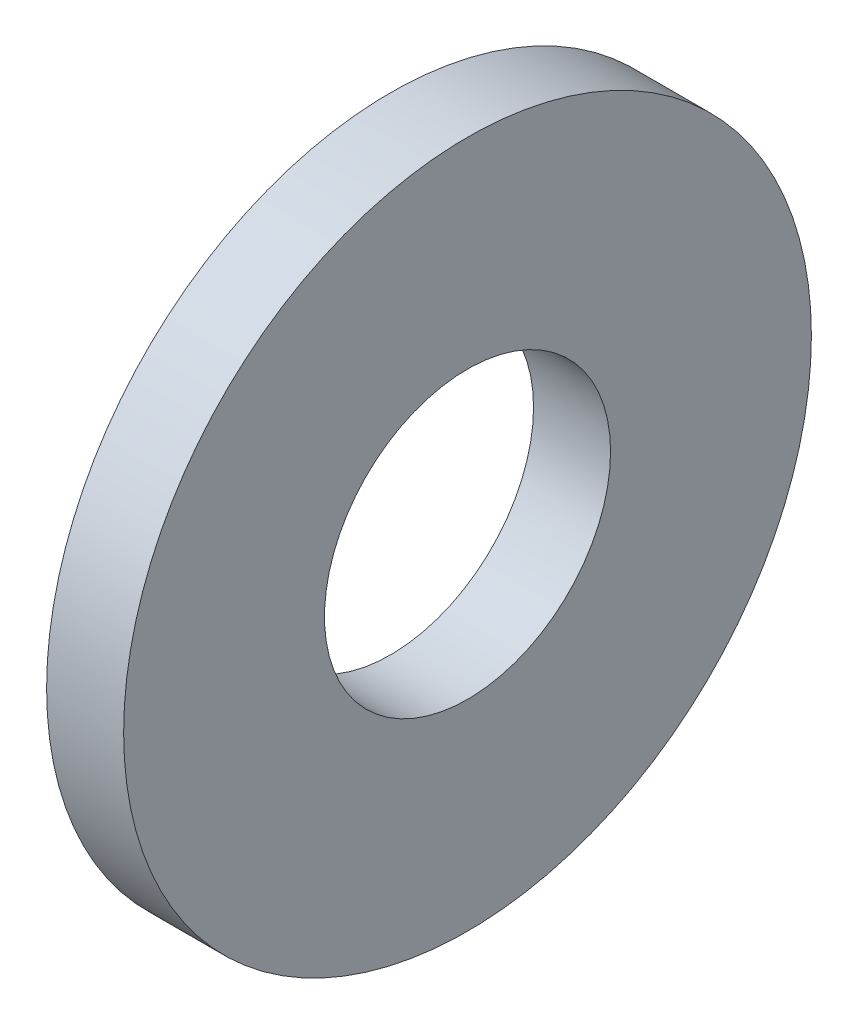
ISO-10303-21;
HEADER;
FILE_DESCRIPTION(('STEP AP214'),'2;1');
FILE_NAME('part.step','',(''),(''),'','','');
FILE_SCHEMA(('AUTOMOTIVE_DESIGN { 1 0 10303 214 1 1 1 1 }'));
ENDSEC;
DATA;
#1=APPLICATION_CONTEXT('core data for automotive mechanical design processes');
#2=APPLICATION_PROTOCOL_DEFINITION('international standard','automotive_design',2000,#1);
#3=PRODUCT_CONTEXT('',#1,'mechanical');
#4=PRODUCT('Part','Part','',(#3));
#5=PRODUCT_RELATED_PRODUCT_CATEGORY('part','',(#4));
#6=PRODUCT_DEFINITION_FORMATION('','',#4);
#7=PRODUCT_DEFINITION_CONTEXT('part definition',#1,'design');
#8=PRODUCT_DEFINITION('design','',#6,#7);
#9=PRODUCT_DEFINITION_SHAPE('','',#8);
#10=(LENGTH_UNIT() NAMED_UNIT(*) SI_UNIT(.MILLI.,.METRE.));
#11=(NAMED_UNIT(*) PLANE_ANGLE_UNIT() SI_UNIT($,.RADIAN.));
#12=(NAMED_UNIT(*) SI_UNIT($,.STERADIAN.) SOLID_ANGLE_UNIT());
#13=UNCERTAINTY_MEASURE_WITH_UNIT(LENGTH_MEASURE(1.E-05),#10,'distance_accuracy_value','');
#14=(GEOMETRIC_REPRESENTATION_CONTEXT(3) GLOBAL_UNCERTAINTY_ASSIGNED_CONTEXT((#13)) GLOBAL_UNIT_ASSIGNED_CONTEXT((#10,
#11,#12)) REPRESENTATION_CONTEXT('',''));
#15=CARTESIAN_POINT('',(0.,0.,0.));
#16=DIRECTION('',(0.,0.,1.));
#17=DIRECTION('',(1.,0.,0.));
#18=AXIS2_PLACEMENT_3D('',#15,#16,#17);
#19=CARTESIAN_POINT('',(1.778,0.,0.));
#20=DIRECTION('',(1.,0.,0.));
#21=DIRECTION('',(0.,0.,-1.));
#22=AXIS2_PLACEMENT_3D('',#19,#20,#21);
#23=PLANE('',#22);
#24=CARTESIAN_POINT('',(1.778,0.,0.));
#25=DIRECTION('',(1.,0.,0.));
#26=DIRECTION('',(0.,0.,-1.));
#27=AXIS2_PLACEMENT_3D('',#24,#25,#26);
#28=CIRCLE('',#27,7.9375);
#29=CARTESIAN_POINT('',(1.778,0.,-7.9375));
#30=VERTEX_POINT('',#29);
#31=EDGE_CURVE('E10',#30,#30,#28,.T.);
#32=ORIENTED_EDGE('',*,*,#31,.T.);
#33=EDGE_LOOP('',(#32));
#34=FACE_BOUND('',#33,.T.);
#35=CARTESIAN_POINT('',(1.778,0.,0.));
#36=DIRECTION('',(1.,0.,0.));
#37=DIRECTION('',(0.,0.,-1.));
#38=AXIS2_PLACEMENT_3D('',#35,#36,#37);
#39=CIRCLE('',#38,3.302);
#40=CARTESIAN_POINT('',(1.778,0.,-3.302));
#41=VERTEX_POINT('',#40);
#42=EDGE_CURVE('E43',#41,#41,#39,.T.);
#43=ORIENTED_EDGE('',*,*,#42,.F.);
#44=EDGE_LOOP('',(#43));
#45=FACE_BOUND('',#44,.T.);
#46=ADVANCED_FACE('F32',(#34,#45),#23,.T.);
#47=CARTESIAN_POINT('',(0.,0.,0.));
#48=DIRECTION('',(1.,0.,0.));
#49=DIRECTION('',(0.,0.,-1.));
#50=AXIS2_PLACEMENT_3D('',#47,#48,#49);
#51=PLANE('',#50);
#52=CARTESIAN_POINT('',(0.,0.,0.));
#53=DIRECTION('',(1.,0.,0.));
#54=DIRECTION('',(0.,0.,-1.));
#55=AXIS2_PLACEMENT_3D('',#52,#53,#54);
#56=CIRCLE('',#55,7.9375);
#57=CARTESIAN_POINT('',(0.,0.,-7.9375));
#58=VERTEX_POINT('',#57);
#59=EDGE_CURVE('E36',#58,#58,#56,.T.);
#60=ORIENTED_EDGE('',*,*,#59,.F.);
#61=EDGE_LOOP('',(#60));
#62=FACE_BOUND('',#61,.T.);
#63=CARTESIAN_POINT('',(0.,0.,0.));
#64=DIRECTION('',(1.,0.,0.));
#65=DIRECTION('',(0.,0.,-1.));
#66=AXIS2_PLACEMENT_3D('',#63,#64,#65);
#67=CIRCLE('',#66,3.302);
#68=CARTESIAN_POINT('',(0.,0.,-3.302));
#69=VERTEX_POINT('',#68);
#70=EDGE_CURVE('E45',#69,#69,#67,.T.);
#71=ORIENTED_EDGE('',*,*,#70,.T.);
#72=EDGE_LOOP('',(#71));
#73=FACE_BOUND('',#72,.T.);
#74=ADVANCED_FACE('F55',(#62,#73),#51,.F.);
#75=CARTESIAN_POINT('',(1.778,0.,0.));
#76=DIRECTION('',(-1.,0.,0.));
#77=DIRECTION('',(0.,0.,1.));
#78=AXIS2_PLACEMENT_3D('',#75,#76,#77);
#79=CYLINDRICAL_SURFACE('',#78,7.9375);
#80=ORIENTED_EDGE('',*,*,#31,.F.);
#81=EDGE_LOOP('',(#80));
#82=FACE_BOUND('',#81,.T.);
#83=ORIENTED_EDGE('',*,*,#59,.T.);
#84=EDGE_LOOP('',(#83));
#85=FACE_BOUND('',#84,.T.);
#86=ADVANCED_FACE('F34',(#82,#85),#79,.T.);
#87=CARTESIAN_POINT('',(1.778,0.,0.));
#88=DIRECTION('',(-1.,0.,0.));
#89=DIRECTION('',(0.,0.,1.));
#90=AXIS2_PLACEMENT_3D('',#87,#88,#89);
#91=CYLINDRICAL_SURFACE('',#90,3.302);
#92=ORIENTED_EDGE('',*,*,#42,.T.);
#93=EDGE_LOOP('',(#92));
#94=FACE_BOUND('',#93,.T.);
#95=ORIENTED_EDGE('',*,*,#70,.F.);
#96=EDGE_LOOP('',(#95));
#97=FACE_BOUND('',#96,.T.);
#98=ADVANCED_FACE('F51',(#94,#97),#91,.F.);
#99=CLOSED_SHELL('',(#46,#74,#86,#98));
#100=MANIFOLD_SOLID_BREP('B2',#99);
#101=ADVANCED_BREP_SHAPE_REPRESENTATION('',(#18,#100),#14);
#102=SHAPE_DEFINITION_REPRESENTATION(#9,#101);
ENDSEC;
END-ISO-10303-21;
